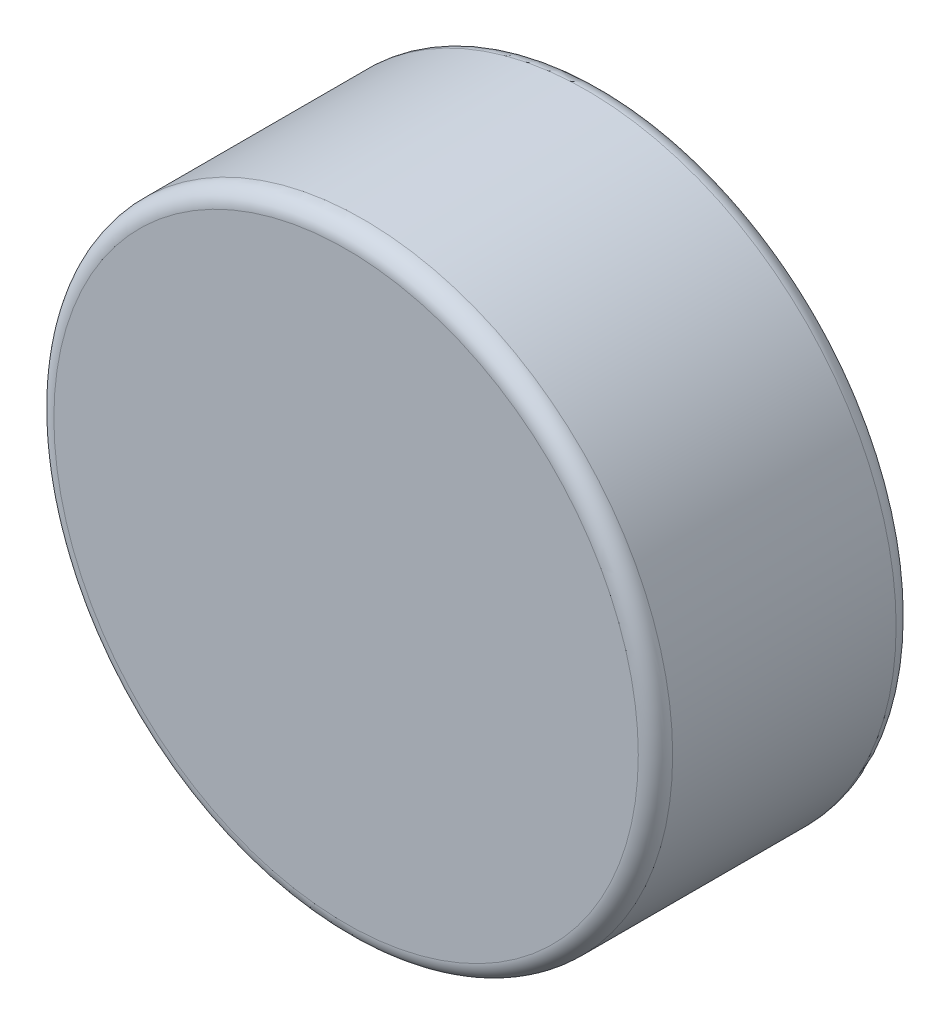
ISO-10303-21;
HEADER;
FILE_DESCRIPTION(('STEP AP214'),'2;1');
FILE_NAME('part.step','',(''),(''),'','','');
FILE_SCHEMA(('AUTOMOTIVE_DESIGN { 1 0 10303 214 1 1 1 1 }'));
ENDSEC;
DATA;
#1=APPLICATION_CONTEXT('core data for automotive mechanical design processes');
#2=APPLICATION_PROTOCOL_DEFINITION('international standard','automotive_design',2000,#1);
#3=PRODUCT_CONTEXT('',#1,'mechanical');
#4=PRODUCT('Part','Part','',(#3));
#5=PRODUCT_RELATED_PRODUCT_CATEGORY('part','',(#4));
#6=PRODUCT_DEFINITION_FORMATION('','',#4);
#7=PRODUCT_DEFINITION_CONTEXT('part definition',#1,'design');
#8=PRODUCT_DEFINITION('design','',#6,#7);
#9=PRODUCT_DEFINITION_SHAPE('','',#8);
#10=(LENGTH_UNIT() NAMED_UNIT(*) SI_UNIT(.MILLI.,.METRE.));
#11=(NAMED_UNIT(*) PLANE_ANGLE_UNIT() SI_UNIT($,.RADIAN.));
#12=(NAMED_UNIT(*) SI_UNIT($,.STERADIAN.) SOLID_ANGLE_UNIT());
#13=UNCERTAINTY_MEASURE_WITH_UNIT(LENGTH_MEASURE(1.E-05),#10,'distance_accuracy_value','');
#14=(GEOMETRIC_REPRESENTATION_CONTEXT(3) GLOBAL_UNCERTAINTY_ASSIGNED_CONTEXT((#13)) GLOBAL_UNIT_ASSIGNED_CONTEXT((#10,
#11,#12)) REPRESENTATION_CONTEXT('',''));
#15=CARTESIAN_POINT('',(0.,0.,0.));
#16=DIRECTION('',(0.,0.,1.));
#17=DIRECTION('',(1.,0.,0.));
#18=AXIS2_PLACEMENT_3D('',#15,#16,#17);
#19=CARTESIAN_POINT('',(0.,0.,3.));
#20=DIRECTION('',(0.,0.,-1.));
#21=DIRECTION('',(-1.,0.,0.));
#22=AXIS2_PLACEMENT_3D('',#19,#20,#21);
#23=CYLINDRICAL_SURFACE('',#22,3.6);
#24=CARTESIAN_POINT('',(0.,0.,0.2));
#25=DIRECTION('',(0.,0.,1.));
#26=DIRECTION('',(1.,0.,0.));
#27=AXIS2_PLACEMENT_3D('',#24,#25,#26);
#28=CIRCLE('',#27,3.6);
#29=CARTESIAN_POINT('',(3.6,0.,0.2));
#30=VERTEX_POINT('',#29);
#31=EDGE_CURVE('E44',#30,#30,#28,.T.);
#32=ORIENTED_EDGE('',*,*,#31,.T.);
#33=EDGE_LOOP('',(#32));
#34=FACE_BOUND('',#33,.T.);
#35=CARTESIAN_POINT('',(0.,0.,2.8));
#36=DIRECTION('',(0.,0.,1.));
#37=DIRECTION('',(1.,0.,0.));
#38=AXIS2_PLACEMENT_3D('',#35,#36,#37);
#39=CIRCLE('',#38,3.6);
#40=CARTESIAN_POINT('',(3.6,0.,2.8));
#41=VERTEX_POINT('',#40);
#42=EDGE_CURVE('E48',#41,#41,#39,.F.);
#43=ORIENTED_EDGE('',*,*,#42,.T.);
#44=EDGE_LOOP('',(#43));
#45=FACE_BOUND('',#44,.T.);
#46=ADVANCED_FACE('F33',(#34,#45),#23,.T.);
#47=CARTESIAN_POINT('',(0.,0.,3.));
#48=DIRECTION('',(0.,0.,1.));
#49=DIRECTION('',(1.,0.,0.));
#50=AXIS2_PLACEMENT_3D('',#47,#48,#49);
#51=PLANE('',#50);
#52=CARTESIAN_POINT('',(0.,0.,3.));
#53=DIRECTION('',(0.,0.,1.));
#54=DIRECTION('',(1.,0.,0.));
#55=AXIS2_PLACEMENT_3D('',#52,#53,#54);
#56=CIRCLE('',#55,3.4);
#57=CARTESIAN_POINT('',(3.4,0.,3.));
#58=VERTEX_POINT('',#57);
#59=EDGE_CURVE('E10',#58,#58,#56,.T.);
#60=ORIENTED_EDGE('',*,*,#59,.T.);
#61=EDGE_LOOP('',(#60));
#62=FACE_BOUND('',#61,.T.);
#63=ADVANCED_FACE('F64',(#62),#51,.T.);
#64=CARTESIAN_POINT('',(0.,0.,0.));
#65=DIRECTION('',(0.,0.,1.));
#66=DIRECTION('',(1.,0.,0.));
#67=AXIS2_PLACEMENT_3D('',#64,#65,#66);
#68=PLANE('',#67);
#69=CARTESIAN_POINT('',(0.,0.,0.));
#70=DIRECTION('',(0.,0.,1.));
#71=DIRECTION('',(1.,0.,0.));
#72=AXIS2_PLACEMENT_3D('',#69,#70,#71);
#73=CIRCLE('',#72,3.4);
#74=CARTESIAN_POINT('',(3.4,0.,0.));
#75=VERTEX_POINT('',#74);
#76=EDGE_CURVE('E40',#75,#75,#73,.F.);
#77=ORIENTED_EDGE('',*,*,#76,.T.);
#78=EDGE_LOOP('',(#77));
#79=FACE_BOUND('',#78,.T.);
#80=ADVANCED_FACE('F61',(#79),#68,.F.);
#81=CARTESIAN_POINT('',(0.,0.,0.2));
#82=DIRECTION('',(0.,0.,1.));
#83=DIRECTION('',(1.,0.,0.));
#84=AXIS2_PLACEMENT_3D('',#81,#82,#83);
#85=TOROIDAL_SURFACE('',#84,3.4,0.2);
#86=ORIENTED_EDGE('',*,*,#76,.F.);
#87=EDGE_LOOP('',(#86));
#88=FACE_BOUND('',#87,.T.);
#89=ORIENTED_EDGE('',*,*,#31,.F.);
#90=EDGE_LOOP('',(#89));
#91=FACE_BOUND('',#90,.T.);
#92=ADVANCED_FACE('F57',(#88,#91),#85,.T.);
#93=CARTESIAN_POINT('',(0.,0.,2.8));
#94=DIRECTION('',(0.,0.,1.));
#95=DIRECTION('',(1.,0.,0.));
#96=AXIS2_PLACEMENT_3D('',#93,#94,#95);
#97=TOROIDAL_SURFACE('',#96,3.4,0.2);
#98=ORIENTED_EDGE('',*,*,#42,.F.);
#99=EDGE_LOOP('',(#98));
#100=FACE_BOUND('',#99,.T.);
#101=ORIENTED_EDGE('',*,*,#59,.F.);
#102=EDGE_LOOP('',(#101));
#103=FACE_BOUND('',#102,.T.);
#104=ADVANCED_FACE('F35',(#100,#103),#97,.T.);
#105=CLOSED_SHELL('',(#46,#63,#80,#92,#104));
#106=MANIFOLD_SOLID_BREP('B2',#105);
#107=ADVANCED_BREP_SHAPE_REPRESENTATION('',(#18,#106),#14);
#108=SHAPE_DEFINITION_REPRESENTATION(#9,#107);
ENDSEC;
END-ISO-10303-21;
